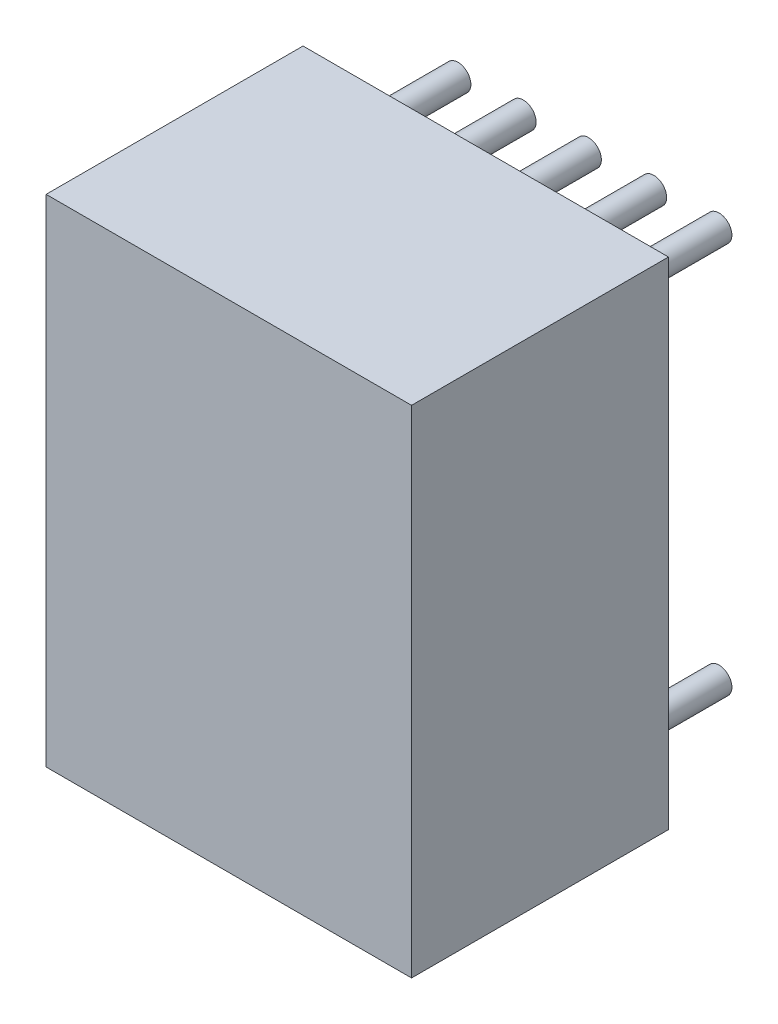
ISO-10303-21;
HEADER;
FILE_DESCRIPTION(('STEP AP214'),'2;1');
FILE_NAME('part.step','',(''),(''),'','','');
FILE_SCHEMA(('AUTOMOTIVE_DESIGN { 1 0 10303 214 1 1 1 1 }'));
ENDSEC;
DATA;
#1=APPLICATION_CONTEXT('core data for automotive mechanical design processes');
#2=APPLICATION_PROTOCOL_DEFINITION('international standard','automotive_design',2000,#1);
#3=PRODUCT_CONTEXT('',#1,'mechanical');
#4=PRODUCT('Part','Part','',(#3));
#5=PRODUCT_RELATED_PRODUCT_CATEGORY('part','',(#4));
#6=PRODUCT_DEFINITION_FORMATION('','',#4);
#7=PRODUCT_DEFINITION_CONTEXT('part definition',#1,'design');
#8=PRODUCT_DEFINITION('design','',#6,#7);
#9=PRODUCT_DEFINITION_SHAPE('','',#8);
#10=(LENGTH_UNIT() NAMED_UNIT(*) SI_UNIT(.MILLI.,.METRE.));
#11=(NAMED_UNIT(*) PLANE_ANGLE_UNIT() SI_UNIT($,.RADIAN.));
#12=(NAMED_UNIT(*) SI_UNIT($,.STERADIAN.) SOLID_ANGLE_UNIT());
#13=UNCERTAINTY_MEASURE_WITH_UNIT(LENGTH_MEASURE(1.E-05),#10,'distance_accuracy_value','');
#14=(GEOMETRIC_REPRESENTATION_CONTEXT(3) GLOBAL_UNCERTAINTY_ASSIGNED_CONTEXT((#13)) GLOBAL_UNIT_ASSIGNED_CONTEXT((#10,
#11,#12)) REPRESENTATION_CONTEXT('',''));
#15=CARTESIAN_POINT('',(0.,0.,0.));
#16=DIRECTION('',(0.,0.,1.));
#17=DIRECTION('',(1.,0.,0.));
#18=AXIS2_PLACEMENT_3D('',#15,#16,#17);
#19=CARTESIAN_POINT('',(0.,7.62,-2.));
#20=DIRECTION('',(0.,0.,1.));
#21=DIRECTION('',(1.,0.,0.));
#22=AXIS2_PLACEMENT_3D('',#19,#20,#21);
#23=CYLINDRICAL_SURFACE('',#22,0.25);
#24=CARTESIAN_POINT('',(0.,7.62,-2.));
#25=DIRECTION('',(0.,0.,1.));
#26=DIRECTION('',(1.,0.,0.));
#27=AXIS2_PLACEMENT_3D('',#24,#25,#26);
#28=CIRCLE('',#27,0.25);
#29=CARTESIAN_POINT('',(0.25,7.62,-2.));
#30=VERTEX_POINT('',#29);
#31=EDGE_CURVE('E11',#30,#30,#28,.T.);
#32=ORIENTED_EDGE('',*,*,#31,.T.);
#33=EDGE_LOOP('',(#32));
#34=FACE_BOUND('',#33,.T.);
#35=CARTESIAN_POINT('',(0.,7.62,0.));
#36=DIRECTION('',(0.,0.,1.));
#37=DIRECTION('',(1.,0.,0.));
#38=AXIS2_PLACEMENT_3D('',#35,#36,#37);
#39=CIRCLE('',#38,0.25);
#40=CARTESIAN_POINT('',(0.25,7.62,0.));
#41=VERTEX_POINT('',#40);
#42=EDGE_CURVE('E43',#41,#41,#39,.T.);
#43=ORIENTED_EDGE('',*,*,#42,.F.);
#44=EDGE_LOOP('',(#43));
#45=FACE_BOUND('',#44,.T.);
#46=ADVANCED_FACE('F40',(#34,#45),#23,.T.);
#47=CARTESIAN_POINT('',(0.,7.62,-2.));
#48=DIRECTION('',(0.,0.,1.));
#49=DIRECTION('',(1.,0.,0.));
#50=AXIS2_PLACEMENT_3D('',#47,#48,#49);
#51=PLANE('',#50);
#52=ORIENTED_EDGE('',*,*,#31,.F.);
#53=EDGE_LOOP('',(#52));
#54=FACE_BOUND('',#53,.T.);
#55=ADVANCED_FACE('F55',(#54),#51,.F.);
#56=CARTESIAN_POINT('',(0.,7.62,0.));
#57=DIRECTION('',(0.,0.,1.));
#58=DIRECTION('',(1.,0.,0.));
#59=AXIS2_PLACEMENT_3D('',#56,#57,#58);
#60=PLANE('',#59);
#61=ORIENTED_EDGE('',*,*,#42,.T.);
#62=EDGE_LOOP('',(#61));
#63=FACE_BOUND('',#62,.T.);
#64=ADVANCED_FACE('F52',(#63),#60,.T.);
#65=CLOSED_SHELL('',(#46,#55,#64));
#66=MANIFOLD_SOLID_BREP('B2',#65);
#67=CARTESIAN_POINT('',(1.27,7.62,-2.));
#68=DIRECTION('',(0.,0.,1.));
#69=DIRECTION('',(1.,0.,0.));
#70=AXIS2_PLACEMENT_3D('',#67,#68,#69);
#71=CYLINDRICAL_SURFACE('',#70,0.25);
#72=CARTESIAN_POINT('',(1.27,7.62,-2.));
#73=DIRECTION('',(0.,0.,1.));
#74=DIRECTION('',(1.,0.,0.));
#75=AXIS2_PLACEMENT_3D('',#72,#73,#74);
#76=CIRCLE('',#75,0.25);
#77=CARTESIAN_POINT('',(1.52,7.62,-2.));
#78=VERTEX_POINT('',#77);
#79=EDGE_CURVE('E39',#78,#78,#76,.T.);
#80=ORIENTED_EDGE('',*,*,#79,.T.);
#81=EDGE_LOOP('',(#80));
#82=FACE_BOUND('',#81,.T.);
#83=CARTESIAN_POINT('',(1.27,7.62,0.));
#84=DIRECTION('',(0.,0.,1.));
#85=DIRECTION('',(1.,0.,0.));
#86=AXIS2_PLACEMENT_3D('',#83,#84,#85);
#87=CIRCLE('',#86,0.25);
#88=CARTESIAN_POINT('',(1.52,7.62,0.));
#89=VERTEX_POINT('',#88);
#90=EDGE_CURVE('E92',#89,#89,#87,.T.);
#91=ORIENTED_EDGE('',*,*,#90,.F.);
#92=EDGE_LOOP('',(#91));
#93=FACE_BOUND('',#92,.T.);
#94=ADVANCED_FACE('F89',(#82,#93),#71,.T.);
#95=CARTESIAN_POINT('',(1.27,7.62,-2.));
#96=DIRECTION('',(0.,0.,1.));
#97=DIRECTION('',(1.,0.,0.));
#98=AXIS2_PLACEMENT_3D('',#95,#96,#97);
#99=PLANE('',#98);
#100=ORIENTED_EDGE('',*,*,#79,.F.);
#101=EDGE_LOOP('',(#100));
#102=FACE_BOUND('',#101,.T.);
#103=ADVANCED_FACE('F104',(#102),#99,.F.);
#104=CARTESIAN_POINT('',(1.27,7.62,0.));
#105=DIRECTION('',(0.,0.,1.));
#106=DIRECTION('',(1.,0.,0.));
#107=AXIS2_PLACEMENT_3D('',#104,#105,#106);
#108=PLANE('',#107);
#109=ORIENTED_EDGE('',*,*,#90,.T.);
#110=EDGE_LOOP('',(#109));
#111=FACE_BOUND('',#110,.T.);
#112=ADVANCED_FACE('F101',(#111),#108,.T.);
#113=CLOSED_SHELL('',(#94,#103,#112));
#114=MANIFOLD_SOLID_BREP('B6',#113);
#115=CARTESIAN_POINT('',(2.54,7.62,-2.));
#116=DIRECTION('',(0.,0.,1.));
#117=DIRECTION('',(1.,0.,0.));
#118=AXIS2_PLACEMENT_3D('',#115,#116,#117);
#119=CYLINDRICAL_SURFACE('',#118,0.25);
#120=CARTESIAN_POINT('',(2.54,7.62,-2.));
#121=DIRECTION('',(0.,0.,1.));
#122=DIRECTION('',(1.,0.,0.));
#123=AXIS2_PLACEMENT_3D('',#120,#121,#122);
#124=CIRCLE('',#123,0.25);
#125=CARTESIAN_POINT('',(2.79,7.62,-2.));
#126=VERTEX_POINT('',#125);
#127=EDGE_CURVE('E88',#126,#126,#124,.T.);
#128=ORIENTED_EDGE('',*,*,#127,.T.);
#129=EDGE_LOOP('',(#128));
#130=FACE_BOUND('',#129,.T.);
#131=CARTESIAN_POINT('',(2.54,7.62,0.));
#132=DIRECTION('',(0.,0.,1.));
#133=DIRECTION('',(1.,0.,0.));
#134=AXIS2_PLACEMENT_3D('',#131,#132,#133);
#135=CIRCLE('',#134,0.25);
#136=CARTESIAN_POINT('',(2.79,7.62,0.));
#137=VERTEX_POINT('',#136);
#138=EDGE_CURVE('E141',#137,#137,#135,.T.);
#139=ORIENTED_EDGE('',*,*,#138,.F.);
#140=EDGE_LOOP('',(#139));
#141=FACE_BOUND('',#140,.T.);
#142=ADVANCED_FACE('F138',(#130,#141),#119,.T.);
#143=CARTESIAN_POINT('',(2.54,7.62,-2.));
#144=DIRECTION('',(0.,0.,1.));
#145=DIRECTION('',(1.,0.,0.));
#146=AXIS2_PLACEMENT_3D('',#143,#144,#145);
#147=PLANE('',#146);
#148=ORIENTED_EDGE('',*,*,#127,.F.);
#149=EDGE_LOOP('',(#148));
#150=FACE_BOUND('',#149,.T.);
#151=ADVANCED_FACE('F153',(#150),#147,.F.);
#152=CARTESIAN_POINT('',(2.54,7.62,0.));
#153=DIRECTION('',(0.,0.,1.));
#154=DIRECTION('',(1.,0.,0.));
#155=AXIS2_PLACEMENT_3D('',#152,#153,#154);
#156=PLANE('',#155);
#157=ORIENTED_EDGE('',*,*,#138,.T.);
#158=EDGE_LOOP('',(#157));
#159=FACE_BOUND('',#158,.T.);
#160=ADVANCED_FACE('F150',(#159),#156,.T.);
#161=CLOSED_SHELL('',(#142,#151,#160));
#162=MANIFOLD_SOLID_BREP('B34',#161);
#163=CARTESIAN_POINT('',(3.81,7.62,-2.));
#164=DIRECTION('',(0.,0.,1.));
#165=DIRECTION('',(1.,0.,0.));
#166=AXIS2_PLACEMENT_3D('',#163,#164,#165);
#167=CYLINDRICAL_SURFACE('',#166,0.25);
#168=CARTESIAN_POINT('',(3.81,7.62,-2.));
#169=DIRECTION('',(0.,0.,1.));
#170=DIRECTION('',(1.,0.,0.));
#171=AXIS2_PLACEMENT_3D('',#168,#169,#170);
#172=CIRCLE('',#171,0.25);
#173=CARTESIAN_POINT('',(4.06,7.62,-2.));
#174=VERTEX_POINT('',#173);
#175=EDGE_CURVE('E137',#174,#174,#172,.T.);
#176=ORIENTED_EDGE('',*,*,#175,.T.);
#177=EDGE_LOOP('',(#176));
#178=FACE_BOUND('',#177,.T.);
#179=CARTESIAN_POINT('',(3.81,7.62,0.));
#180=DIRECTION('',(0.,0.,1.));
#181=DIRECTION('',(1.,0.,0.));
#182=AXIS2_PLACEMENT_3D('',#179,#180,#181);
#183=CIRCLE('',#182,0.25);
#184=CARTESIAN_POINT('',(4.06,7.62,0.));
#185=VERTEX_POINT('',#184);
#186=EDGE_CURVE('E190',#185,#185,#183,.T.);
#187=ORIENTED_EDGE('',*,*,#186,.F.);
#188=EDGE_LOOP('',(#187));
#189=FACE_BOUND('',#188,.T.);
#190=ADVANCED_FACE('F187',(#178,#189),#167,.T.);
#191=CARTESIAN_POINT('',(3.81,7.62,-2.));
#192=DIRECTION('',(0.,0.,1.));
#193=DIRECTION('',(1.,0.,0.));
#194=AXIS2_PLACEMENT_3D('',#191,#192,#193);
#195=PLANE('',#194);
#196=ORIENTED_EDGE('',*,*,#175,.F.);
#197=EDGE_LOOP('',(#196));
#198=FACE_BOUND('',#197,.T.);
#199=ADVANCED_FACE('F202',(#198),#195,.F.);
#200=CARTESIAN_POINT('',(3.81,7.62,0.));
#201=DIRECTION('',(0.,0.,1.));
#202=DIRECTION('',(1.,0.,0.));
#203=AXIS2_PLACEMENT_3D('',#200,#201,#202);
#204=PLANE('',#203);
#205=ORIENTED_EDGE('',*,*,#186,.T.);
#206=EDGE_LOOP('',(#205));
#207=FACE_BOUND('',#206,.T.);
#208=ADVANCED_FACE('F199',(#207),#204,.T.);
#209=CLOSED_SHELL('',(#190,#199,#208));
#210=MANIFOLD_SOLID_BREP('B83',#209);
#211=CARTESIAN_POINT('',(5.08,7.62,-2.));
#212=DIRECTION('',(0.,0.,1.));
#213=DIRECTION('',(1.,0.,0.));
#214=AXIS2_PLACEMENT_3D('',#211,#212,#213);
#215=CYLINDRICAL_SURFACE('',#214,0.25);
#216=CARTESIAN_POINT('',(5.08,7.62,-2.));
#217=DIRECTION('',(0.,0.,1.));
#218=DIRECTION('',(1.,0.,0.));
#219=AXIS2_PLACEMENT_3D('',#216,#217,#218);
#220=CIRCLE('',#219,0.25);
#221=CARTESIAN_POINT('',(5.33,7.62,-2.));
#222=VERTEX_POINT('',#221);
#223=EDGE_CURVE('E186',#222,#222,#220,.T.);
#224=ORIENTED_EDGE('',*,*,#223,.T.);
#225=EDGE_LOOP('',(#224));
#226=FACE_BOUND('',#225,.T.);
#227=CARTESIAN_POINT('',(5.08,7.62,0.));
#228=DIRECTION('',(0.,0.,1.));
#229=DIRECTION('',(1.,0.,0.));
#230=AXIS2_PLACEMENT_3D('',#227,#228,#229);
#231=CIRCLE('',#230,0.25);
#232=CARTESIAN_POINT('',(5.33,7.62,0.));
#233=VERTEX_POINT('',#232);
#234=EDGE_CURVE('E239',#233,#233,#231,.T.);
#235=ORIENTED_EDGE('',*,*,#234,.F.);
#236=EDGE_LOOP('',(#235));
#237=FACE_BOUND('',#236,.T.);
#238=ADVANCED_FACE('F236',(#226,#237),#215,.T.);
#239=CARTESIAN_POINT('',(5.08,7.62,-2.));
#240=DIRECTION('',(0.,0.,1.));
#241=DIRECTION('',(1.,0.,0.));
#242=AXIS2_PLACEMENT_3D('',#239,#240,#241);
#243=PLANE('',#242);
#244=ORIENTED_EDGE('',*,*,#223,.F.);
#245=EDGE_LOOP('',(#244));
#246=FACE_BOUND('',#245,.T.);
#247=ADVANCED_FACE('F251',(#246),#243,.F.);
#248=CARTESIAN_POINT('',(5.08,7.62,0.));
#249=DIRECTION('',(0.,0.,1.));
#250=DIRECTION('',(1.,0.,0.));
#251=AXIS2_PLACEMENT_3D('',#248,#249,#250);
#252=PLANE('',#251);
#253=ORIENTED_EDGE('',*,*,#234,.T.);
#254=EDGE_LOOP('',(#253));
#255=FACE_BOUND('',#254,.T.);
#256=ADVANCED_FACE('F248',(#255),#252,.T.);
#257=CLOSED_SHELL('',(#238,#247,#256));
#258=MANIFOLD_SOLID_BREP('B132',#257);
#259=CARTESIAN_POINT('',(5.08,0.,-2.));
#260=DIRECTION('',(0.,0.,1.));
#261=DIRECTION('',(1.,0.,0.));
#262=AXIS2_PLACEMENT_3D('',#259,#260,#261);
#263=CYLINDRICAL_SURFACE('',#262,0.25);
#264=CARTESIAN_POINT('',(5.08,0.,-2.));
#265=DIRECTION('',(0.,0.,1.));
#266=DIRECTION('',(1.,0.,0.));
#267=AXIS2_PLACEMENT_3D('',#264,#265,#266);
#268=CIRCLE('',#267,0.25);
#269=CARTESIAN_POINT('',(5.33,0.,-2.));
#270=VERTEX_POINT('',#269);
#271=EDGE_CURVE('E235',#270,#270,#268,.T.);
#272=ORIENTED_EDGE('',*,*,#271,.T.);
#273=EDGE_LOOP('',(#272));
#274=FACE_BOUND('',#273,.T.);
#275=CARTESIAN_POINT('',(5.08,0.,0.));
#276=DIRECTION('',(0.,0.,1.));
#277=DIRECTION('',(1.,0.,0.));
#278=AXIS2_PLACEMENT_3D('',#275,#276,#277);
#279=CIRCLE('',#278,0.25);
#280=CARTESIAN_POINT('',(5.33,0.,0.));
#281=VERTEX_POINT('',#280);
#282=EDGE_CURVE('E288',#281,#281,#279,.T.);
#283=ORIENTED_EDGE('',*,*,#282,.F.);
#284=EDGE_LOOP('',(#283));
#285=FACE_BOUND('',#284,.T.);
#286=ADVANCED_FACE('F285',(#274,#285),#263,.T.);
#287=CARTESIAN_POINT('',(5.08,0.,-2.));
#288=DIRECTION('',(0.,0.,1.));
#289=DIRECTION('',(1.,0.,0.));
#290=AXIS2_PLACEMENT_3D('',#287,#288,#289);
#291=PLANE('',#290);
#292=ORIENTED_EDGE('',*,*,#271,.F.);
#293=EDGE_LOOP('',(#292));
#294=FACE_BOUND('',#293,.T.);
#295=ADVANCED_FACE('F300',(#294),#291,.F.);
#296=CARTESIAN_POINT('',(5.08,0.,0.));
#297=DIRECTION('',(0.,0.,1.));
#298=DIRECTION('',(1.,0.,0.));
#299=AXIS2_PLACEMENT_3D('',#296,#297,#298);
#300=PLANE('',#299);
#301=ORIENTED_EDGE('',*,*,#282,.T.);
#302=EDGE_LOOP('',(#301));
#303=FACE_BOUND('',#302,.T.);
#304=ADVANCED_FACE('F297',(#303),#300,.T.);
#305=CLOSED_SHELL('',(#286,#295,#304));
#306=MANIFOLD_SOLID_BREP('B181',#305);
#307=CARTESIAN_POINT('',(3.81,0.,-2.));
#308=DIRECTION('',(0.,0.,1.));
#309=DIRECTION('',(1.,0.,0.));
#310=AXIS2_PLACEMENT_3D('',#307,#308,#309);
#311=CYLINDRICAL_SURFACE('',#310,0.25);
#312=CARTESIAN_POINT('',(3.81,0.,-2.));
#313=DIRECTION('',(0.,0.,1.));
#314=DIRECTION('',(1.,0.,0.));
#315=AXIS2_PLACEMENT_3D('',#312,#313,#314);
#316=CIRCLE('',#315,0.25);
#317=CARTESIAN_POINT('',(4.06,0.,-2.));
#318=VERTEX_POINT('',#317);
#319=EDGE_CURVE('E284',#318,#318,#316,.T.);
#320=ORIENTED_EDGE('',*,*,#319,.T.);
#321=EDGE_LOOP('',(#320));
#322=FACE_BOUND('',#321,.T.);
#323=CARTESIAN_POINT('',(3.81,0.,0.));
#324=DIRECTION('',(0.,0.,1.));
#325=DIRECTION('',(1.,0.,0.));
#326=AXIS2_PLACEMENT_3D('',#323,#324,#325);
#327=CIRCLE('',#326,0.25);
#328=CARTESIAN_POINT('',(4.06,0.,0.));
#329=VERTEX_POINT('',#328);
#330=EDGE_CURVE('E337',#329,#329,#327,.T.);
#331=ORIENTED_EDGE('',*,*,#330,.F.);
#332=EDGE_LOOP('',(#331));
#333=FACE_BOUND('',#332,.T.);
#334=ADVANCED_FACE('F334',(#322,#333),#311,.T.);
#335=CARTESIAN_POINT('',(3.81,0.,-2.));
#336=DIRECTION('',(0.,0.,1.));
#337=DIRECTION('',(1.,0.,0.));
#338=AXIS2_PLACEMENT_3D('',#335,#336,#337);
#339=PLANE('',#338);
#340=ORIENTED_EDGE('',*,*,#319,.F.);
#341=EDGE_LOOP('',(#340));
#342=FACE_BOUND('',#341,.T.);
#343=ADVANCED_FACE('F349',(#342),#339,.F.);
#344=CARTESIAN_POINT('',(3.81,0.,0.));
#345=DIRECTION('',(0.,0.,1.));
#346=DIRECTION('',(1.,0.,0.));
#347=AXIS2_PLACEMENT_3D('',#344,#345,#346);
#348=PLANE('',#347);
#349=ORIENTED_EDGE('',*,*,#330,.T.);
#350=EDGE_LOOP('',(#349));
#351=FACE_BOUND('',#350,.T.);
#352=ADVANCED_FACE('F346',(#351),#348,.T.);
#353=CLOSED_SHELL('',(#334,#343,#352));
#354=MANIFOLD_SOLID_BREP('B230',#353);
#355=CARTESIAN_POINT('',(2.54,0.,-2.));
#356=DIRECTION('',(0.,0.,1.));
#357=DIRECTION('',(1.,0.,0.));
#358=AXIS2_PLACEMENT_3D('',#355,#356,#357);
#359=CYLINDRICAL_SURFACE('',#358,0.25);
#360=CARTESIAN_POINT('',(2.54,0.,-2.));
#361=DIRECTION('',(0.,0.,1.));
#362=DIRECTION('',(1.,0.,0.));
#363=AXIS2_PLACEMENT_3D('',#360,#361,#362);
#364=CIRCLE('',#363,0.25);
#365=CARTESIAN_POINT('',(2.79,0.,-2.));
#366=VERTEX_POINT('',#365);
#367=EDGE_CURVE('E333',#366,#366,#364,.T.);
#368=ORIENTED_EDGE('',*,*,#367,.T.);
#369=EDGE_LOOP('',(#368));
#370=FACE_BOUND('',#369,.T.);
#371=CARTESIAN_POINT('',(2.54,0.,0.));
#372=DIRECTION('',(0.,0.,1.));
#373=DIRECTION('',(1.,0.,0.));
#374=AXIS2_PLACEMENT_3D('',#371,#372,#373);
#375=CIRCLE('',#374,0.25);
#376=CARTESIAN_POINT('',(2.79,0.,0.));
#377=VERTEX_POINT('',#376);
#378=EDGE_CURVE('E386',#377,#377,#375,.T.);
#379=ORIENTED_EDGE('',*,*,#378,.F.);
#380=EDGE_LOOP('',(#379));
#381=FACE_BOUND('',#380,.T.);
#382=ADVANCED_FACE('F383',(#370,#381),#359,.T.);
#383=CARTESIAN_POINT('',(2.54,0.,-2.));
#384=DIRECTION('',(0.,0.,1.));
#385=DIRECTION('',(1.,0.,0.));
#386=AXIS2_PLACEMENT_3D('',#383,#384,#385);
#387=PLANE('',#386);
#388=ORIENTED_EDGE('',*,*,#367,.F.);
#389=EDGE_LOOP('',(#388));
#390=FACE_BOUND('',#389,.T.);
#391=ADVANCED_FACE('F398',(#390),#387,.F.);
#392=CARTESIAN_POINT('',(2.54,0.,0.));
#393=DIRECTION('',(0.,0.,1.));
#394=DIRECTION('',(1.,0.,0.));
#395=AXIS2_PLACEMENT_3D('',#392,#393,#394);
#396=PLANE('',#395);
#397=ORIENTED_EDGE('',*,*,#378,.T.);
#398=EDGE_LOOP('',(#397));
#399=FACE_BOUND('',#398,.T.);
#400=ADVANCED_FACE('F395',(#399),#396,.T.);
#401=CLOSED_SHELL('',(#382,#391,#400));
#402=MANIFOLD_SOLID_BREP('B279',#401);
#403=CARTESIAN_POINT('',(1.27,0.,-2.));
#404=DIRECTION('',(0.,0.,1.));
#405=DIRECTION('',(1.,0.,0.));
#406=AXIS2_PLACEMENT_3D('',#403,#404,#405);
#407=CYLINDRICAL_SURFACE('',#406,0.25);
#408=CARTESIAN_POINT('',(1.27,0.,-2.));
#409=DIRECTION('',(0.,0.,1.));
#410=DIRECTION('',(1.,0.,0.));
#411=AXIS2_PLACEMENT_3D('',#408,#409,#410);
#412=CIRCLE('',#411,0.25);
#413=CARTESIAN_POINT('',(1.52,0.,-2.));
#414=VERTEX_POINT('',#413);
#415=EDGE_CURVE('E382',#414,#414,#412,.T.);
#416=ORIENTED_EDGE('',*,*,#415,.T.);
#417=EDGE_LOOP('',(#416));
#418=FACE_BOUND('',#417,.T.);
#419=CARTESIAN_POINT('',(1.27,0.,0.));
#420=DIRECTION('',(0.,0.,1.));
#421=DIRECTION('',(1.,0.,0.));
#422=AXIS2_PLACEMENT_3D('',#419,#420,#421);
#423=CIRCLE('',#422,0.25);
#424=CARTESIAN_POINT('',(1.52,0.,0.));
#425=VERTEX_POINT('',#424);
#426=EDGE_CURVE('E435',#425,#425,#423,.T.);
#427=ORIENTED_EDGE('',*,*,#426,.F.);
#428=EDGE_LOOP('',(#427));
#429=FACE_BOUND('',#428,.T.);
#430=ADVANCED_FACE('F432',(#418,#429),#407,.T.);
#431=CARTESIAN_POINT('',(1.27,0.,-2.));
#432=DIRECTION('',(0.,0.,1.));
#433=DIRECTION('',(1.,0.,0.));
#434=AXIS2_PLACEMENT_3D('',#431,#432,#433);
#435=PLANE('',#434);
#436=ORIENTED_EDGE('',*,*,#415,.F.);
#437=EDGE_LOOP('',(#436));
#438=FACE_BOUND('',#437,.T.);
#439=ADVANCED_FACE('F447',(#438),#435,.F.);
#440=CARTESIAN_POINT('',(1.27,0.,0.));
#441=DIRECTION('',(0.,0.,1.));
#442=DIRECTION('',(1.,0.,0.));
#443=AXIS2_PLACEMENT_3D('',#440,#441,#442);
#444=PLANE('',#443);
#445=ORIENTED_EDGE('',*,*,#426,.T.);
#446=EDGE_LOOP('',(#445));
#447=FACE_BOUND('',#446,.T.);
#448=ADVANCED_FACE('F444',(#447),#444,.T.);
#449=CLOSED_SHELL('',(#430,#439,#448));
#450=MANIFOLD_SOLID_BREP('B328',#449);
#451=CARTESIAN_POINT('',(0.,0.,-2.));
#452=DIRECTION('',(0.,0.,1.));
#453=DIRECTION('',(1.,0.,0.));
#454=AXIS2_PLACEMENT_3D('',#451,#452,#453);
#455=CYLINDRICAL_SURFACE('',#454,0.25);
#456=CARTESIAN_POINT('',(0.,0.,-2.));
#457=DIRECTION('',(0.,0.,1.));
#458=DIRECTION('',(1.,0.,0.));
#459=AXIS2_PLACEMENT_3D('',#456,#457,#458);
#460=CIRCLE('',#459,0.25);
#461=CARTESIAN_POINT('',(0.25,0.,-2.));
#462=VERTEX_POINT('',#461);
#463=EDGE_CURVE('E431',#462,#462,#460,.T.);
#464=ORIENTED_EDGE('',*,*,#463,.T.);
#465=EDGE_LOOP('',(#464));
#466=FACE_BOUND('',#465,.T.);
#467=CARTESIAN_POINT('',(0.,0.,0.));
#468=DIRECTION('',(0.,0.,1.));
#469=DIRECTION('',(1.,0.,0.));
#470=AXIS2_PLACEMENT_3D('',#467,#468,#469);
#471=CIRCLE('',#470,0.25);
#472=CARTESIAN_POINT('',(0.25,0.,0.));
#473=VERTEX_POINT('',#472);
#474=EDGE_CURVE('E485',#473,#473,#471,.T.);
#475=ORIENTED_EDGE('',*,*,#474,.F.);
#476=EDGE_LOOP('',(#475));
#477=FACE_BOUND('',#476,.T.);
#478=ADVANCED_FACE('F482',(#466,#477),#455,.T.);
#479=CARTESIAN_POINT('',(0.,0.,-2.));
#480=DIRECTION('',(0.,0.,1.));
#481=DIRECTION('',(1.,0.,0.));
#482=AXIS2_PLACEMENT_3D('',#479,#480,#481);
#483=PLANE('',#482);
#484=ORIENTED_EDGE('',*,*,#463,.F.);
#485=EDGE_LOOP('',(#484));
#486=FACE_BOUND('',#485,.T.);
#487=ADVANCED_FACE('F497',(#486),#483,.F.);
#488=CARTESIAN_POINT('',(0.,0.,0.));
#489=DIRECTION('',(0.,0.,1.));
#490=DIRECTION('',(1.,0.,0.));
#491=AXIS2_PLACEMENT_3D('',#488,#489,#490);
#492=PLANE('',#491);
#493=ORIENTED_EDGE('',*,*,#474,.T.);
#494=EDGE_LOOP('',(#493));
#495=FACE_BOUND('',#494,.T.);
#496=ADVANCED_FACE('F494',(#495),#492,.T.);
#497=CLOSED_SHELL('',(#478,#487,#496));
#498=MANIFOLD_SOLID_BREP('B377',#497);
#499=CARTESIAN_POINT('',(6.096,8.636,5.));
#500=DIRECTION('',(0.,-1.,0.));
#501=DIRECTION('',(0.,0.,-1.));
#502=AXIS2_PLACEMENT_3D('',#499,#500,#501);
#503=PLANE('',#502);
#504=DIRECTION('',(-1.,0.,0.));
#505=VECTOR('',#504,1.);
#506=CARTESIAN_POINT('',(6.096,8.636,0.));
#507=LINE('',#506,#505);
#508=CARTESIAN_POINT('',(6.096,8.636,0.));
#509=VERTEX_POINT('',#508);
#510=CARTESIAN_POINT('',(-1.016,8.636,0.));
#511=VERTEX_POINT('',#510);
#512=EDGE_CURVE('E586',#509,#511,#507,.T.);
#513=ORIENTED_EDGE('',*,*,#512,.T.);
#514=DIRECTION('',(0.,0.,-1.));
#515=VECTOR('',#514,1.);
#516=CARTESIAN_POINT('',(-1.016,8.636,5.));
#517=LINE('',#516,#515);
#518=CARTESIAN_POINT('',(-1.016,8.636,5.));
#519=VERTEX_POINT('',#518);
#520=EDGE_CURVE('E480',#519,#511,#517,.T.);
#521=ORIENTED_EDGE('',*,*,#520,.F.);
#522=DIRECTION('',(-1.,0.,0.));
#523=VECTOR('',#522,1.);
#524=CARTESIAN_POINT('',(6.096,8.636,5.));
#525=LINE('',#524,#523);
#526=CARTESIAN_POINT('',(6.096,8.636,5.));
#527=VERTEX_POINT('',#526);
#528=EDGE_CURVE('E574',#527,#519,#525,.T.);
#529=ORIENTED_EDGE('',*,*,#528,.F.);
#530=DIRECTION('',(0.,0.,-1.));
#531=VECTOR('',#530,1.);
#532=CARTESIAN_POINT('',(6.096,8.636,5.));
#533=LINE('',#532,#531);
#534=EDGE_CURVE('E582',#527,#509,#533,.T.);
#535=ORIENTED_EDGE('',*,*,#534,.T.);
#536=EDGE_LOOP('',(#513,#521,#529,#535));
#537=FACE_BOUND('',#536,.T.);
#538=ADVANCED_FACE('F523',(#537),#503,.F.);
#539=CARTESIAN_POINT('',(-1.016,8.636,5.));
#540=DIRECTION('',(1.,0.,0.));
#541=DIRECTION('',(0.,0.,-1.));
#542=AXIS2_PLACEMENT_3D('',#539,#540,#541);
#543=PLANE('',#542);
#544=DIRECTION('',(0.,-1.,0.));
#545=VECTOR('',#544,1.);
#546=CARTESIAN_POINT('',(-1.016,8.636,0.));
#547=LINE('',#546,#545);
#548=CARTESIAN_POINT('',(-1.016,-1.016,0.));
#549=VERTEX_POINT('',#548);
#550=EDGE_CURVE('E578',#511,#549,#547,.T.);
#551=ORIENTED_EDGE('',*,*,#550,.T.);
#552=DIRECTION('',(0.,0.,-1.));
#553=VECTOR('',#552,1.);
#554=CARTESIAN_POINT('',(-1.016,-1.016,5.));
#555=LINE('',#554,#553);
#556=CARTESIAN_POINT('',(-1.016,-1.016,5.));
#557=VERTEX_POINT('',#556);
#558=EDGE_CURVE('E531',#557,#549,#555,.T.);
#559=ORIENTED_EDGE('',*,*,#558,.F.);
#560=DIRECTION('',(0.,-1.,0.));
#561=VECTOR('',#560,1.);
#562=CARTESIAN_POINT('',(-1.016,8.636,5.));
#563=LINE('',#562,#561);
#564=EDGE_CURVE('E569',#519,#557,#563,.T.);
#565=ORIENTED_EDGE('',*,*,#564,.F.);
#566=ORIENTED_EDGE('',*,*,#520,.T.);
#567=EDGE_LOOP('',(#551,#559,#565,#566));
#568=FACE_BOUND('',#567,.T.);
#569=ADVANCED_FACE('F577',(#568),#543,.F.);
#570=CARTESIAN_POINT('',(-1.016,-1.016,5.));
#571=DIRECTION('',(0.,1.,0.));
#572=DIRECTION('',(0.,0.,1.));
#573=AXIS2_PLACEMENT_3D('',#570,#571,#572);
#574=PLANE('',#573);
#575=DIRECTION('',(1.,0.,0.));
#576=VECTOR('',#575,1.);
#577=CARTESIAN_POINT('',(-1.016,-1.016,0.));
#578=LINE('',#577,#576);
#579=CARTESIAN_POINT('',(6.096,-1.016,0.));
#580=VERTEX_POINT('',#579);
#581=EDGE_CURVE('E556',#549,#580,#578,.T.);
#582=ORIENTED_EDGE('',*,*,#581,.T.);
#583=DIRECTION('',(0.,0.,-1.));
#584=VECTOR('',#583,1.);
#585=CARTESIAN_POINT('',(6.096,-1.016,5.));
#586=LINE('',#585,#584);
#587=CARTESIAN_POINT('',(6.096,-1.016,5.));
#588=VERTEX_POINT('',#587);
#589=EDGE_CURVE('E579',#588,#580,#586,.T.);
#590=ORIENTED_EDGE('',*,*,#589,.F.);
#591=DIRECTION('',(1.,0.,0.));
#592=VECTOR('',#591,1.);
#593=CARTESIAN_POINT('',(-1.016,-1.016,5.));
#594=LINE('',#593,#592);
#595=EDGE_CURVE('E572',#557,#588,#594,.T.);
#596=ORIENTED_EDGE('',*,*,#595,.F.);
#597=ORIENTED_EDGE('',*,*,#558,.T.);
#598=EDGE_LOOP('',(#582,#590,#596,#597));
#599=FACE_BOUND('',#598,.T.);
#600=ADVANCED_FACE('F580',(#599),#574,.F.);
#601=CARTESIAN_POINT('',(6.096,-1.016,5.));
#602=DIRECTION('',(-1.,0.,0.));
#603=DIRECTION('',(0.,0.,1.));
#604=AXIS2_PLACEMENT_3D('',#601,#602,#603);
#605=PLANE('',#604);
#606=DIRECTION('',(0.,1.,0.));
#607=VECTOR('',#606,1.);
#608=CARTESIAN_POINT('',(6.096,-1.016,0.));
#609=LINE('',#608,#607);
#610=EDGE_CURVE('E562',#580,#509,#609,.T.);
#611=ORIENTED_EDGE('',*,*,#610,.T.);
#612=ORIENTED_EDGE('',*,*,#534,.F.);
#613=DIRECTION('',(0.,1.,0.));
#614=VECTOR('',#613,1.);
#615=CARTESIAN_POINT('',(6.096,-1.016,5.));
#616=LINE('',#615,#614);
#617=EDGE_CURVE('E539',#588,#527,#616,.T.);
#618=ORIENTED_EDGE('',*,*,#617,.F.);
#619=ORIENTED_EDGE('',*,*,#589,.T.);
#620=EDGE_LOOP('',(#611,#612,#618,#619));
#621=FACE_BOUND('',#620,.T.);
#622=ADVANCED_FACE('F593',(#621),#605,.F.);
#623=CARTESIAN_POINT('',(0.,0.,5.));
#624=DIRECTION('',(0.,0.,1.));
#625=DIRECTION('',(1.,0.,0.));
#626=AXIS2_PLACEMENT_3D('',#623,#624,#625);
#627=PLANE('',#626);
#628=ORIENTED_EDGE('',*,*,#528,.T.);
#629=ORIENTED_EDGE('',*,*,#564,.T.);
#630=ORIENTED_EDGE('',*,*,#595,.T.);
#631=ORIENTED_EDGE('',*,*,#617,.T.);
#632=EDGE_LOOP('',(#628,#629,#630,#631));
#633=FACE_BOUND('',#632,.T.);
#634=ADVANCED_FACE('F570',(#633),#627,.T.);
#635=CARTESIAN_POINT('',(0.,0.,0.));
#636=DIRECTION('',(0.,0.,1.));
#637=DIRECTION('',(1.,0.,0.));
#638=AXIS2_PLACEMENT_3D('',#635,#636,#637);
#639=PLANE('',#638);
#640=ORIENTED_EDGE('',*,*,#512,.F.);
#641=ORIENTED_EDGE('',*,*,#610,.F.);
#642=ORIENTED_EDGE('',*,*,#581,.F.);
#643=ORIENTED_EDGE('',*,*,#550,.F.);
#644=EDGE_LOOP('',(#640,#641,#642,#643));
#645=FACE_BOUND('',#644,.T.);
#646=ADVANCED_FACE('F596',(#645),#639,.F.);
#647=CLOSED_SHELL('',(#538,#569,#600,#622,#634,#646));
#648=MANIFOLD_SOLID_BREP('B426',#647);
#649=ADVANCED_BREP_SHAPE_REPRESENTATION('',(#18,#66,#114,#162,#210,#258,#306,#354,#402,#450,
#498,#648),#14);
#650=SHAPE_DEFINITION_REPRESENTATION(#9,#649);
ENDSEC;
END-ISO-10303-21;
